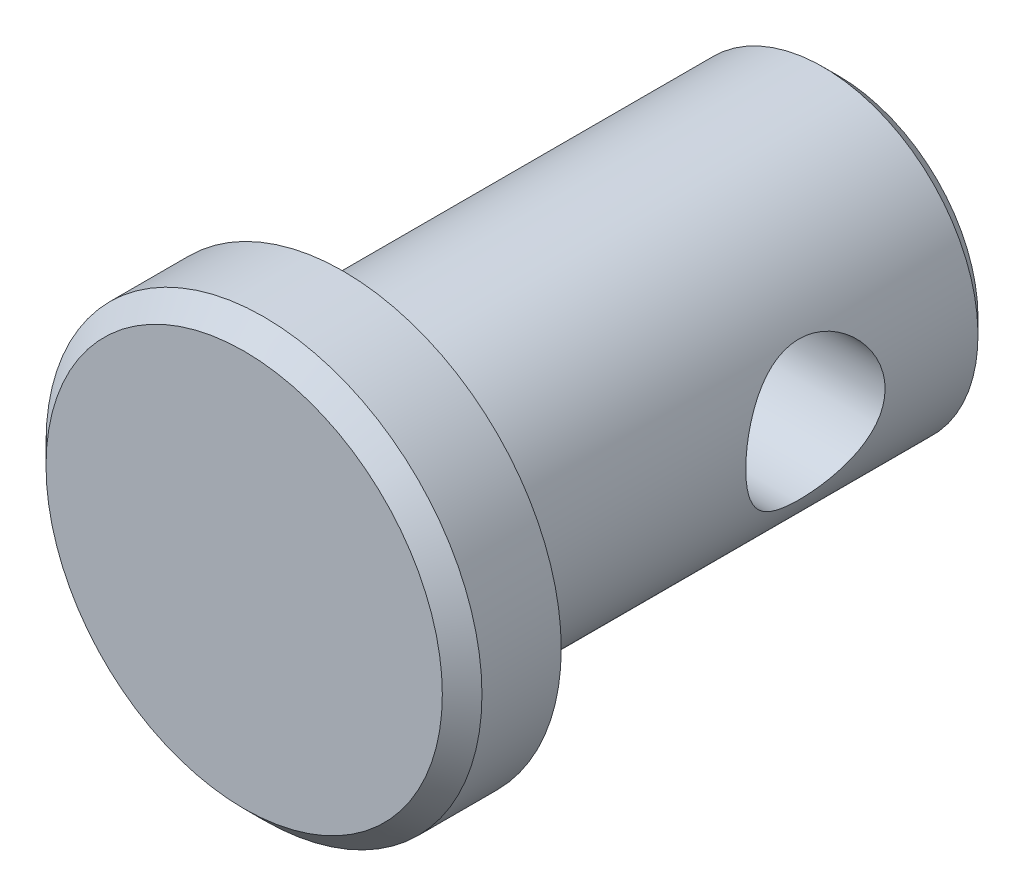
ISO-10303-21;
HEADER;
FILE_DESCRIPTION(('STEP AP214'),'2;1');
FILE_NAME('part.step','',(''),(''),'','','');
FILE_SCHEMA(('AUTOMOTIVE_DESIGN { 1 0 10303 214 1 1 1 1 }'));
ENDSEC;
DATA;
#1=APPLICATION_CONTEXT('core data for automotive mechanical design processes');
#2=APPLICATION_PROTOCOL_DEFINITION('international standard','automotive_design',2000,#1);
#3=PRODUCT_CONTEXT('',#1,'mechanical');
#4=PRODUCT('Part','Part','',(#3));
#5=PRODUCT_RELATED_PRODUCT_CATEGORY('part','',(#4));
#6=PRODUCT_DEFINITION_FORMATION('','',#4);
#7=PRODUCT_DEFINITION_CONTEXT('part definition',#1,'design');
#8=PRODUCT_DEFINITION('design','',#6,#7);
#9=PRODUCT_DEFINITION_SHAPE('','',#8);
#10=(LENGTH_UNIT() NAMED_UNIT(*) SI_UNIT(.MILLI.,.METRE.));
#11=(NAMED_UNIT(*) PLANE_ANGLE_UNIT() SI_UNIT($,.RADIAN.));
#12=(NAMED_UNIT(*) SI_UNIT($,.STERADIAN.) SOLID_ANGLE_UNIT());
#13=UNCERTAINTY_MEASURE_WITH_UNIT(LENGTH_MEASURE(1.E-05),#10,'distance_accuracy_value','');
#14=(GEOMETRIC_REPRESENTATION_CONTEXT(3) GLOBAL_UNCERTAINTY_ASSIGNED_CONTEXT((#13)) GLOBAL_UNIT_ASSIGNED_CONTEXT((#10,
#11,#12)) REPRESENTATION_CONTEXT('',''));
#15=CARTESIAN_POINT('',(0.,0.,0.));
#16=DIRECTION('',(0.,0.,1.));
#17=DIRECTION('',(1.,0.,0.));
#18=AXIS2_PLACEMENT_3D('',#15,#16,#17);
#19=CARTESIAN_POINT('',(0.,0.,-6.35));
#20=DIRECTION('',(0.,0.,1.));
#21=DIRECTION('',(0.,-1.,0.));
#22=AXIS2_PLACEMENT_3D('',#19,#20,#21);
#23=CONICAL_SURFACE('',#22,3.571875,0.78539816339745);
#24=CARTESIAN_POINT('',(0.,0.,-5.953125));
#25=DIRECTION('',(0.,0.,1.));
#26=DIRECTION('',(0.,-1.,0.));
#27=AXIS2_PLACEMENT_3D('',#24,#25,#26);
#28=CIRCLE('',#27,3.96875);
#29=CARTESIAN_POINT('',(0.,-3.96874999999999,-5.953125));
#30=VERTEX_POINT('',#29);
#31=EDGE_CURVE('E10',#30,#30,#28,.T.);
#32=ORIENTED_EDGE('',*,*,#31,.F.);
#33=EDGE_LOOP('',(#32));
#34=FACE_BOUND('',#33,.T.);
#35=CARTESIAN_POINT('',(0.,0.,-6.35));
#36=DIRECTION('',(0.,0.,1.));
#37=DIRECTION('',(0.,-1.,0.));
#38=AXIS2_PLACEMENT_3D('',#35,#36,#37);
#39=CIRCLE('',#38,3.571875);
#40=CARTESIAN_POINT('',(0.,-3.571875,-6.35));
#41=VERTEX_POINT('',#40);
#42=EDGE_CURVE('E97',#41,#41,#39,.T.);
#43=ORIENTED_EDGE('',*,*,#42,.T.);
#44=EDGE_LOOP('',(#43));
#45=FACE_BOUND('',#44,.T.);
#46=ADVANCED_FACE('F33',(#34,#45),#23,.T.);
#47=CARTESIAN_POINT('',(0.,0.,6.35));
#48=DIRECTION('',(0.,0.,1.));
#49=DIRECTION('',(0.,-1.,0.));
#50=AXIS2_PLACEMENT_3D('',#47,#48,#49);
#51=CYLINDRICAL_SURFACE('',#50,3.96875);
#52=CARTESIAN_POINT('',(-3.96875,0.,-3.57187499999999));
#53=CARTESIAN_POINT('',(-3.96874617438622,0.0949778738234461,-3.57187035722332));
#54=CARTESIAN_POINT('',(-3.96530259934115,0.190100910102062,-3.56425385252008));
#55=CARTESIAN_POINT('',(-3.95186976524683,0.377603398261745,-3.53409289456083));
#56=CARTESIAN_POINT('',(-3.94186507359599,0.46997584354683,-3.51151324472013));
#57=CARTESIAN_POINT('',(-3.91637069606117,0.648968721826521,-3.45244875411923));
#58=CARTESIAN_POINT('',(-3.90090078285466,0.735608570631179,-3.41601400402516));
#59=CARTESIAN_POINT('',(-3.86594877361354,0.901447999285699,-3.33050062891982));
#60=CARTESIAN_POINT('',(-3.84646753179613,0.980649157993282,-3.28142469530616));
#61=CARTESIAN_POINT('',(-3.80416954815373,1.13398432523678,-3.16910263612587));
#62=CARTESIAN_POINT('',(-3.7812323323631,1.2076436628228,-3.10525439840265));
#63=CARTESIAN_POINT('',(-3.73507740763258,1.34362938308817,-2.96647997161966));
#64=CARTESIAN_POINT('',(-3.71185953645299,1.40594884000918,-2.89154706297452));
#65=CARTESIAN_POINT('',(-3.66620670648197,1.52117571586779,-2.72734183179056));
#66=CARTESIAN_POINT('',(-3.64390071699522,1.57330159549786,-2.63748130672191));
#67=CARTESIAN_POINT('',(-3.60455031138587,1.66148802946916,-2.44913034248971));
#68=CARTESIAN_POINT('',(-3.58750275311297,1.69755818356412,-2.35064510233513));
#69=CARTESIAN_POINT('',(-3.56192529512775,1.75056975181475,-2.15329038310296));
#70=CARTESIAN_POINT('',(-3.55298881993969,1.76843057064752,-2.05472282035861));
#71=CARTESIAN_POINT('',(-3.54350139065343,1.78737214090788,-1.8556165258032));
#72=CARTESIAN_POINT('',(-3.54294461635166,1.78846453901733,-1.75507921070493));
#73=CARTESIAN_POINT('',(-3.54994141249622,1.77452269382132,-1.56481308368874));
#74=CARTESIAN_POINT('',(-3.55675159739714,1.7609667262888,-1.47494271247179));
#75=CARTESIAN_POINT('',(-3.57644085651668,1.72062366969459,-1.29892268119766));
#76=CARTESIAN_POINT('',(-3.58932134024889,1.6938335076046,-1.21277389035982));
#77=CARTESIAN_POINT('',(-3.61999879597095,1.62725210855021,-1.04430618435152));
#78=CARTESIAN_POINT('',(-3.63790043052348,1.58718038036525,-0.962118055284008));
#79=CARTESIAN_POINT('',(-3.67658878575605,1.49537598597763,-0.805279937283571));
#80=CARTESIAN_POINT('',(-3.69737673266191,1.44363835775407,-0.730633175647767));
#81=CARTESIAN_POINT('',(-3.74202161728027,1.32390460607897,-0.583127902294695));
#82=CARTESIAN_POINT('',(-3.76597742851696,1.25479921909777,-0.511196922266941));
#83=CARTESIAN_POINT('',(-3.81252979441669,1.10531402437861,-0.379604319886757));
#84=CARTESIAN_POINT('',(-3.83512591597318,1.02493065110591,-0.319946592490662));
#85=CARTESIAN_POINT('',(-3.87728164517011,0.851950400611564,-0.21291250331343));
#86=CARTESIAN_POINT('',(-3.89672549715337,0.759052301739583,-0.165973866696274));
#87=CARTESIAN_POINT('',(-3.92946512008061,0.565578480308633,-0.088726985157656));
#88=CARTESIAN_POINT('',(-3.94276486430751,0.465007768662616,-0.0584079902420303));
#89=CARTESIAN_POINT('',(-3.96093706398566,0.266740423937715,-0.0173418447466681));
#90=CARTESIAN_POINT('',(-3.96634260111458,0.169349837037097,-0.00535375618133482));
#91=CARTESIAN_POINT('',(-3.96986639576799,-0.0261960161241942,0.00248394042760269));
#92=CARTESIAN_POINT('',(-3.96798721258835,-0.124351001740545,-0.00166078368926123));
#93=CARTESIAN_POINT('',(-3.9574884590475,-0.31242507770026,-0.0251400693185713));
#94=CARTESIAN_POINT('',(-3.94927933787845,-0.402485338607085,-0.0435499840328754));
#95=CARTESIAN_POINT('',(-3.92741674577169,-0.578108898424095,-0.0936887966837619));
#96=CARTESIAN_POINT('',(-3.91376261909991,-0.663671654301141,-0.125419298823535));
#97=CARTESIAN_POINT('',(-3.88175972760447,-0.830900107030836,-0.202298733514667));
#98=CARTESIAN_POINT('',(-3.86327809956836,-0.912361689031192,-0.247834486741642));
#99=CARTESIAN_POINT('',(-3.82352241163918,-1.0667805898273,-0.350610362256922));
#100=CARTESIAN_POINT('',(-3.80224713175163,-1.13973416672261,-0.407855604234516));
#101=CARTESIAN_POINT('',(-3.75698613652709,-1.28140881747875,-0.537916702089414));
#102=CARTESIAN_POINT('',(-3.73292154548769,-1.34928558884681,-0.611626973216289));
#103=CARTESIAN_POINT('',(-3.68626006612451,-1.47199966484125,-0.769668072596691));
#104=CARTESIAN_POINT('',(-3.66366374315174,-1.52683196811846,-0.854002955513507));
#105=CARTESIAN_POINT('',(-3.6220582670028,-1.62311458805353,-1.03378952014529));
#106=CARTESIAN_POINT('',(-3.60315571336035,-1.6641865299815,-1.12947046380782));
#107=CARTESIAN_POINT('',(-3.57239877714008,-1.72923710343425,-1.32752018890961));
#108=CARTESIAN_POINT('',(-3.5605372740767,-1.75323300854316,-1.42988209730045));
#109=CARTESIAN_POINT('',(-3.54641768025877,-1.78160782388324,-1.62889200836469));
#110=CARTESIAN_POINT('',(-3.54341998323755,-1.78749927212071,-1.72527206886119));
#111=CARTESIAN_POINT('',(-3.54535000484541,-1.78366948684158,-1.91762907737205));
#112=CARTESIAN_POINT('',(-3.55027591495678,-1.77395181601726,-2.01360611236192));
#113=CARTESIAN_POINT('',(-3.56677687348632,-1.74051392909838,-2.19612195883695));
#114=CARTESIAN_POINT('',(-3.57791211367527,-1.71771729466601,-2.28287394500893));
#115=CARTESIAN_POINT('',(-3.6051626662439,-1.65975853119642,-2.45130396918139));
#116=CARTESIAN_POINT('',(-3.62127942761947,-1.62459280389831,-2.53298052255652));
#117=CARTESIAN_POINT('',(-3.65796501776635,-1.54029485813948,-2.69473567441377));
#118=CARTESIAN_POINT('',(-3.67875446372189,-1.49040607677892,-2.774368801699));
#119=CARTESIAN_POINT('',(-3.7219314339033,-1.37904587307233,-2.9246019951886));
#120=CARTESIAN_POINT('',(-3.74431964392808,-1.31756946138292,-2.99519814823002));
#121=CARTESIAN_POINT('',(-3.7906044226433,-1.17819988334134,-3.13196495681766));
#122=CARTESIAN_POINT('',(-3.81445387976054,-1.09932398288879,-3.19715519459277));
#123=CARTESIAN_POINT('',(-3.85900563461188,-0.930928545506914,-3.31348922158046));
#124=CARTESIAN_POINT('',(-3.87970648291034,-0.84140414021696,-3.36462655034042));
#125=CARTESIAN_POINT('',(-3.91548302476265,-0.654900541569404,-3.45060540216689));
#126=CARTESIAN_POINT('',(-3.9306127661094,-0.558004611467578,-3.48560437779795));
#127=CARTESIAN_POINT('',(-3.95373955592654,-0.358998712324299,-3.53842882002151));
#128=CARTESIAN_POINT('',(-3.9617582306156,-0.256905557576822,-3.5563063697479));
#129=CARTESIAN_POINT('',(-3.96675460869473,-0.128456865581504,-3.56743623719068));
#130=CARTESIAN_POINT('',(-3.96750154708539,-0.102802547124713,-3.56909916176177));
#131=CARTESIAN_POINT('',(-3.96849976418159,-0.0514357022290026,-3.57131917944275));
#132=CARTESIAN_POINT('',(-3.96875103610376,-0.0257231749982951,-3.57187625741872));
#133=CARTESIAN_POINT('',(-3.96875,0.,-3.57187499999999));
#134=B_SPLINE_CURVE_WITH_KNOTS('',3,(#52,#53,#54,#55,#56,#57,#58,#59,#60,#61,#62,#63,#64,#65,
#66,#67,#68,#69,#70,#71,#72,#73,#74,#75,#76,#77,#78,#79,#80,#81,#82,#83,#84,#85,#86,#87,#88,#89,
#90,#91,#92,#93,#94,#95,#96,#97,#98,#99,#100,#101,#102,#103,#104,#105,#106,#107,#108,#109,#110,
#111,#112,#113,#114,#115,#116,#117,#118,#119,#120,#121,#122,#123,#124,#125,#126,#127,#128,#129,
#130,#131,#132,#133),.UNSPECIFIED.,.T.,.F.,(4,2,2,2,2,2,2,2,2,2,2,2,2,2,2,2,2,2,2,2,2,2,2,2,2,2,
2,2,2,2,2,2,2,2,2,2,2,2,2,2,4),(0.,0.284828038773507,0.570328444753487,0.854806339300563,
1.13922371647665,1.43836698800565,1.73769235057741,2.05484351698026,2.37180480245163,
2.6718240414938,2.97163488960177,3.24379026768138,3.5160088709595,3.79438770250796,
4.07288516494024,4.37926965204657,4.68575122177784,5.00172742428917,5.31749900370298,
5.61076439689949,5.90392676831248,6.17953050358858,6.45516743944874,6.73938144201624,
7.02371997688966,7.33149162707355,7.63938108977511,7.95514987865637,8.27059878990354,
8.55885899679167,8.84705341928242,9.11703762338687,9.38710043294563,9.67464025936008,
9.96230417721746,10.2760302632386,10.5899003361528,10.9006397585277,11.2104308849966,
11.2875707589972,11.3647116886774),.UNSPECIFIED.);
#135=CARTESIAN_POINT('',(-3.96875,0.,-3.57187499999999));
#136=VERTEX_POINT('',#135);
#137=EDGE_CURVE('E36',#136,#136,#134,.T.);
#138=ORIENTED_EDGE('',*,*,#137,.T.);
#139=EDGE_LOOP('',(#138));
#140=FACE_BOUND('',#139,.T.);
#141=CARTESIAN_POINT('',(3.96875,0.,-3.57187499999999));
#142=CARTESIAN_POINT('',(3.96874617438622,-0.0949778738234462,-3.57187035722332));
#143=CARTESIAN_POINT('',(3.96530259934115,-0.190100910102062,-3.56425385252008));
#144=CARTESIAN_POINT('',(3.95186976524683,-0.377603398261745,-3.53409289456083));
#145=CARTESIAN_POINT('',(3.94186507359598,-0.46997584354683,-3.51151324472013));
#146=CARTESIAN_POINT('',(3.91637069606117,-0.648968721826521,-3.45244875411923));
#147=CARTESIAN_POINT('',(3.90090078285466,-0.735608570631179,-3.41601400402516));
#148=CARTESIAN_POINT('',(3.86594877361353,-0.901447999285699,-3.33050062891982));
#149=CARTESIAN_POINT('',(3.84646753179613,-0.980649157993282,-3.28142469530616));
#150=CARTESIAN_POINT('',(3.80416954815373,-1.13398432523678,-3.16910263612587));
#151=CARTESIAN_POINT('',(3.7812323323631,-1.2076436628228,-3.10525439840265));
#152=CARTESIAN_POINT('',(3.73507740763258,-1.34362938308817,-2.96647997161966));
#153=CARTESIAN_POINT('',(3.71185953645298,-1.40594884000918,-2.89154706297452));
#154=CARTESIAN_POINT('',(3.66620670648197,-1.52117571586779,-2.72734183179056));
#155=CARTESIAN_POINT('',(3.64390071699522,-1.57330159549786,-2.63748130672191));
#156=CARTESIAN_POINT('',(3.60455031138587,-1.66148802946916,-2.44913034248971));
#157=CARTESIAN_POINT('',(3.58750275311297,-1.69755818356412,-2.35064510233513));
#158=CARTESIAN_POINT('',(3.56192529512775,-1.75056975181475,-2.15329038310296));
#159=CARTESIAN_POINT('',(3.55298881993968,-1.76843057064752,-2.05472282035861));
#160=CARTESIAN_POINT('',(3.54350139065343,-1.78737214090788,-1.8556165258032));
#161=CARTESIAN_POINT('',(3.54294461635166,-1.78846453901733,-1.75507921070493));
#162=CARTESIAN_POINT('',(3.54994141249622,-1.77452269382132,-1.56481308368874));
#163=CARTESIAN_POINT('',(3.55675159739714,-1.7609667262888,-1.47494271247179));
#164=CARTESIAN_POINT('',(3.57644085651668,-1.72062366969459,-1.29892268119766));
#165=CARTESIAN_POINT('',(3.58932134024889,-1.6938335076046,-1.21277389035982));
#166=CARTESIAN_POINT('',(3.61999879597094,-1.62725210855021,-1.04430618435152));
#167=CARTESIAN_POINT('',(3.63790043052347,-1.58718038036525,-0.962118055284007));
#168=CARTESIAN_POINT('',(3.67658878575605,-1.49537598597763,-0.805279937283571));
#169=CARTESIAN_POINT('',(3.69737673266191,-1.44363835775407,-0.730633175647767));
#170=CARTESIAN_POINT('',(3.74202161728027,-1.32390460607897,-0.583127902294695));
#171=CARTESIAN_POINT('',(3.76597742851696,-1.25479921909777,-0.511196922266941));
#172=CARTESIAN_POINT('',(3.81252979441669,-1.10531402437861,-0.379604319886757));
#173=CARTESIAN_POINT('',(3.83512591597318,-1.02493065110591,-0.319946592490662));
#174=CARTESIAN_POINT('',(3.87728164517011,-0.851950400611563,-0.212912503313431));
#175=CARTESIAN_POINT('',(3.89672549715337,-0.759052301739582,-0.165973866696274));
#176=CARTESIAN_POINT('',(3.92946512008061,-0.565578480308633,-0.0887269851576562));
#177=CARTESIAN_POINT('',(3.94276486430751,-0.465007768662616,-0.0584079902420302));
#178=CARTESIAN_POINT('',(3.96093706398566,-0.266740423937716,-0.017341844746668));
#179=CARTESIAN_POINT('',(3.96634260111458,-0.169349837037098,-0.0053537561813349));
#180=CARTESIAN_POINT('',(3.96986639576799,0.026196016124194,0.00248394042760265));
#181=CARTESIAN_POINT('',(3.96798721258835,0.124351001740545,-0.00166078368926106));
#182=CARTESIAN_POINT('',(3.9574884590475,0.312425077700259,-0.0251400693185712));
#183=CARTESIAN_POINT('',(3.94927933787845,0.402485338607085,-0.0435499840328755));
#184=CARTESIAN_POINT('',(3.92741674577169,0.578108898424095,-0.093688796683762));
#185=CARTESIAN_POINT('',(3.91376261909991,0.663671654301141,-0.125419298823535));
#186=CARTESIAN_POINT('',(3.88175972760447,0.830900107030836,-0.202298733514666));
#187=CARTESIAN_POINT('',(3.86327809956836,0.912361689031191,-0.247834486741642));
#188=CARTESIAN_POINT('',(3.82352241163918,1.0667805898273,-0.350610362256922));
#189=CARTESIAN_POINT('',(3.80224713175163,1.13973416672261,-0.407855604234516));
#190=CARTESIAN_POINT('',(3.75698613652709,1.28140881747875,-0.537916702089413));
#191=CARTESIAN_POINT('',(3.73292154548769,1.3492855888468,-0.611626973216288));
#192=CARTESIAN_POINT('',(3.68626006612451,1.47199966484125,-0.76966807259669));
#193=CARTESIAN_POINT('',(3.66366374315174,1.52683196811846,-0.854002955513506));
#194=CARTESIAN_POINT('',(3.6220582670028,1.62311458805353,-1.03378952014529));
#195=CARTESIAN_POINT('',(3.60315571336035,1.6641865299815,-1.12947046380782));
#196=CARTESIAN_POINT('',(3.57239877714008,1.72923710343425,-1.32752018890961));
#197=CARTESIAN_POINT('',(3.5605372740767,1.75323300854316,-1.42988209730045));
#198=CARTESIAN_POINT('',(3.54641768025877,1.78160782388324,-1.62889200836469));
#199=CARTESIAN_POINT('',(3.54341998323755,1.78749927212071,-1.72527206886119));
#200=CARTESIAN_POINT('',(3.54535000484541,1.78366948684158,-1.91762907737205));
#201=CARTESIAN_POINT('',(3.55027591495678,1.77395181601726,-2.01360611236192));
#202=CARTESIAN_POINT('',(3.56677687348632,1.74051392909838,-2.19612195883695));
#203=CARTESIAN_POINT('',(3.57791211367527,1.71771729466601,-2.28287394500893));
#204=CARTESIAN_POINT('',(3.6051626662439,1.65975853119642,-2.45130396918139));
#205=CARTESIAN_POINT('',(3.62127942761947,1.62459280389831,-2.53298052255652));
#206=CARTESIAN_POINT('',(3.65796501776635,1.54029485813948,-2.69473567441377));
#207=CARTESIAN_POINT('',(3.67875446372189,1.49040607677892,-2.774368801699));
#208=CARTESIAN_POINT('',(3.7219314339033,1.37904587307233,-2.9246019951886));
#209=CARTESIAN_POINT('',(3.74431964392809,1.31756946138292,-2.99519814823002));
#210=CARTESIAN_POINT('',(3.7906044226433,1.17819988334134,-3.13196495681766));
#211=CARTESIAN_POINT('',(3.81445387976054,1.09932398288879,-3.19715519459277));
#212=CARTESIAN_POINT('',(3.85900563461188,0.930928545506914,-3.31348922158046));
#213=CARTESIAN_POINT('',(3.87970648291034,0.84140414021696,-3.36462655034042));
#214=CARTESIAN_POINT('',(3.91548302476265,0.654900541569403,-3.45060540216689));
#215=CARTESIAN_POINT('',(3.9306127661094,0.558004611467577,-3.48560437779795));
#216=CARTESIAN_POINT('',(3.95373955592654,0.358998712324298,-3.53842882002151));
#217=CARTESIAN_POINT('',(3.9617582306156,0.256905557576822,-3.5563063697479));
#218=CARTESIAN_POINT('',(3.96675460869473,0.128456865581504,-3.56743623719068));
#219=CARTESIAN_POINT('',(3.96750154708539,0.102802547124713,-3.56909916176177));
#220=CARTESIAN_POINT('',(3.96849976418159,0.0514357022290026,-3.57131917944275));
#221=CARTESIAN_POINT('',(3.96875103610376,0.0257231749982951,-3.57187625741872));
#222=CARTESIAN_POINT('',(3.96875,0.,-3.57187499999999));
#223=B_SPLINE_CURVE_WITH_KNOTS('',3,(#141,#142,#143,#144,#145,#146,#147,#148,#149,#150,#151,
#152,#153,#154,#155,#156,#157,#158,#159,#160,#161,#162,#163,#164,#165,#166,#167,#168,#169,#170,
#171,#172,#173,#174,#175,#176,#177,#178,#179,#180,#181,#182,#183,#184,#185,#186,#187,#188,#189,
#190,#191,#192,#193,#194,#195,#196,#197,#198,#199,#200,#201,#202,#203,#204,#205,#206,#207,#208,
#209,#210,#211,#212,#213,#214,#215,#216,#217,#218,#219,#220,#221,#222),.UNSPECIFIED.,.T.,.F.,(4,
2,2,2,2,2,2,2,2,2,2,2,2,2,2,2,2,2,2,2,2,2,2,2,2,2,2,2,2,2,2,2,2,2,2,2,2,2,2,2,4),(0.,
0.284828038773507,0.570328444753487,0.854806339300563,1.13922371647665,1.43836698800565,
1.73769235057741,2.05484351698026,2.37180480245163,2.6718240414938,2.97163488960177,
3.24379026768138,3.5160088709595,3.79438770250796,4.07288516494024,4.37926965204657,
4.68575122177784,5.00172742428917,5.31749900370298,5.61076439689949,5.90392676831248,
6.17953050358858,6.45516743944874,6.73938144201624,7.02371997688966,7.33149162707355,
7.63938108977511,7.95514987865636,8.27059878990353,8.55885899679166,8.84705341928242,
9.11703762338686,9.38710043294563,9.67464025936007,9.96230417721746,10.2760302632386,
10.5899003361528,10.9006397585277,11.2104308849966,11.2875707589972,11.3647116886774),.UNSPECIFIED.);
#224=CARTESIAN_POINT('',(3.96875,0.,-3.57187499999999));
#225=VERTEX_POINT('',#224);
#226=EDGE_CURVE('E52',#225,#225,#223,.T.);
#227=ORIENTED_EDGE('',*,*,#226,.T.);
#228=EDGE_LOOP('',(#227));
#229=FACE_BOUND('',#228,.T.);
#230=CARTESIAN_POINT('',(0.,0.,6.35));
#231=DIRECTION('',(0.,0.,1.));
#232=DIRECTION('',(0.,-1.,0.));
#233=AXIS2_PLACEMENT_3D('',#230,#231,#232);
#234=CIRCLE('',#233,3.96875);
#235=CARTESIAN_POINT('',(0.,-3.96875,6.35));
#236=VERTEX_POINT('',#235);
#237=EDGE_CURVE('E44',#236,#236,#234,.T.);
#238=ORIENTED_EDGE('',*,*,#237,.F.);
#239=EDGE_LOOP('',(#238));
#240=FACE_BOUND('',#239,.T.);
#241=ORIENTED_EDGE('',*,*,#31,.T.);
#242=EDGE_LOOP('',(#241));
#243=FACE_BOUND('',#242,.T.);
#244=ADVANCED_FACE('F57',(#140,#229,#240,#243),#51,.T.);
#245=CARTESIAN_POINT('',(0.,5.588,6.35));
#246=DIRECTION('',(0.,0.,1.));
#247=DIRECTION('',(0.,-1.,0.));
#248=AXIS2_PLACEMENT_3D('',#245,#246,#247);
#249=PLANE('',#248);
#250=CARTESIAN_POINT('',(0.,0.,6.35));
#251=DIRECTION('',(0.,0.,1.));
#252=DIRECTION('',(0.,-1.,0.));
#253=AXIS2_PLACEMENT_3D('',#250,#251,#252);
#254=CIRCLE('',#253,5.588);
#255=CARTESIAN_POINT('',(0.,-5.588,6.35));
#256=VERTEX_POINT('',#255);
#257=EDGE_CURVE('E49',#256,#256,#254,.T.);
#258=ORIENTED_EDGE('',*,*,#257,.F.);
#259=EDGE_LOOP('',(#258));
#260=FACE_BOUND('',#259,.T.);
#261=ORIENTED_EDGE('',*,*,#237,.T.);
#262=EDGE_LOOP('',(#261));
#263=FACE_BOUND('',#262,.T.);
#264=ADVANCED_FACE('F80',(#260,#263),#249,.F.);
#265=CARTESIAN_POINT('',(0.,0.,6.35));
#266=DIRECTION('',(0.,0.,1.));
#267=DIRECTION('',(0.,-1.,0.));
#268=AXIS2_PLACEMENT_3D('',#265,#266,#267);
#269=CYLINDRICAL_SURFACE('',#268,5.588);
#270=CARTESIAN_POINT('',(0.,0.,8.382));
#271=DIRECTION('',(0.,0.,1.));
#272=DIRECTION('',(0.,-1.,0.));
#273=AXIS2_PLACEMENT_3D('',#270,#271,#272);
#274=CIRCLE('',#273,5.588);
#275=CARTESIAN_POINT('',(0.,-5.588,8.382));
#276=VERTEX_POINT('',#275);
#277=EDGE_CURVE('E101',#276,#276,#274,.T.);
#278=ORIENTED_EDGE('',*,*,#277,.F.);
#279=EDGE_LOOP('',(#278));
#280=FACE_BOUND('',#279,.T.);
#281=ORIENTED_EDGE('',*,*,#257,.T.);
#282=EDGE_LOOP('',(#281));
#283=FACE_BOUND('',#282,.T.);
#284=ADVANCED_FACE('F77',(#280,#283),#269,.T.);
#285=CARTESIAN_POINT('',(0.,0.,8.382));
#286=DIRECTION('',(0.,0.,-1.));
#287=DIRECTION('',(0.,1.,0.));
#288=AXIS2_PLACEMENT_3D('',#285,#286,#287);
#289=CONICAL_SURFACE('',#288,5.588,0.785398163397446);
#290=CARTESIAN_POINT('',(0.,0.,8.89));
#291=DIRECTION('',(0.,0.,1.));
#292=DIRECTION('',(0.,-1.,0.));
#293=AXIS2_PLACEMENT_3D('',#290,#291,#292);
#294=CIRCLE('',#293,5.08);
#295=CARTESIAN_POINT('',(0.,-5.08,8.89));
#296=VERTEX_POINT('',#295);
#297=EDGE_CURVE('E98',#296,#296,#294,.T.);
#298=ORIENTED_EDGE('',*,*,#297,.F.);
#299=EDGE_LOOP('',(#298));
#300=FACE_BOUND('',#299,.T.);
#301=ORIENTED_EDGE('',*,*,#277,.T.);
#302=EDGE_LOOP('',(#301));
#303=FACE_BOUND('',#302,.T.);
#304=ADVANCED_FACE('F73',(#300,#303),#289,.T.);
#305=CARTESIAN_POINT('',(0.,0.,8.89));
#306=DIRECTION('',(0.,0.,-1.));
#307=DIRECTION('',(0.,1.,0.));
#308=AXIS2_PLACEMENT_3D('',#305,#306,#307);
#309=PLANE('',#308);
#310=ORIENTED_EDGE('',*,*,#297,.T.);
#311=EDGE_LOOP('',(#310));
#312=FACE_BOUND('',#311,.T.);
#313=ADVANCED_FACE('F69',(#312),#309,.F.);
#314=CARTESIAN_POINT('',(0.,3.571875,-6.35));
#315=DIRECTION('',(0.,0.,1.));
#316=DIRECTION('',(0.,-1.,0.));
#317=AXIS2_PLACEMENT_3D('',#314,#315,#316);
#318=PLANE('',#317);
#319=ORIENTED_EDGE('',*,*,#42,.F.);
#320=EDGE_LOOP('',(#319));
#321=FACE_BOUND('',#320,.T.);
#322=ADVANCED_FACE('F64',(#321),#318,.F.);
#323=CARTESIAN_POINT('',(-5.588,0.,-1.78593749999999));
#324=DIRECTION('',(1.,0.,0.));
#325=DIRECTION('',(0.,0.,-1.));
#326=AXIS2_PLACEMENT_3D('',#323,#324,#325);
#327=CYLINDRICAL_SURFACE('',#326,1.7859375);
#328=ORIENTED_EDGE('',*,*,#226,.F.);
#329=EDGE_LOOP('',(#328));
#330=FACE_BOUND('',#329,.T.);
#331=ORIENTED_EDGE('',*,*,#137,.F.);
#332=EDGE_LOOP('',(#331));
#333=FACE_BOUND('',#332,.T.);
#334=ADVANCED_FACE('F60',(#330,#333),#327,.F.);
#335=CLOSED_SHELL('',(#46,#244,#264,#284,#304,#313,#322,#334));
#336=MANIFOLD_SOLID_BREP('B2',#335);
#337=ADVANCED_BREP_SHAPE_REPRESENTATION('',(#18,#336),#14);
#338=SHAPE_DEFINITION_REPRESENTATION(#9,#337);
ENDSEC;
END-ISO-10303-21;
